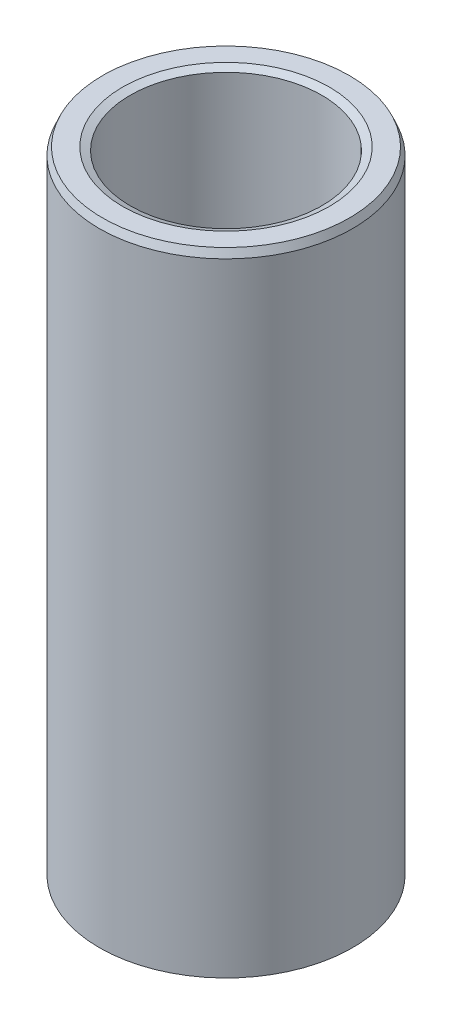
ISO-10303-21;
HEADER;
FILE_DESCRIPTION(('STEP AP214'),'2;1');
FILE_NAME('part.step','',(''),(''),'','','');
FILE_SCHEMA(('AUTOMOTIVE_DESIGN { 1 0 10303 214 1 1 1 1 }'));
ENDSEC;
DATA;
#1=APPLICATION_CONTEXT('core data for automotive mechanical design processes');
#2=APPLICATION_PROTOCOL_DEFINITION('international standard','automotive_design',2000,#1);
#3=PRODUCT_CONTEXT('',#1,'mechanical');
#4=PRODUCT('Part','Part','',(#3));
#5=PRODUCT_RELATED_PRODUCT_CATEGORY('part','',(#4));
#6=PRODUCT_DEFINITION_FORMATION('','',#4);
#7=PRODUCT_DEFINITION_CONTEXT('part definition',#1,'design');
#8=PRODUCT_DEFINITION('design','',#6,#7);
#9=PRODUCT_DEFINITION_SHAPE('','',#8);
#10=(LENGTH_UNIT() NAMED_UNIT(*) SI_UNIT(.MILLI.,.METRE.));
#11=(NAMED_UNIT(*) PLANE_ANGLE_UNIT() SI_UNIT($,.RADIAN.));
#12=(NAMED_UNIT(*) SI_UNIT($,.STERADIAN.) SOLID_ANGLE_UNIT());
#13=UNCERTAINTY_MEASURE_WITH_UNIT(LENGTH_MEASURE(1.E-05),#10,'distance_accuracy_value','');
#14=(GEOMETRIC_REPRESENTATION_CONTEXT(3) GLOBAL_UNCERTAINTY_ASSIGNED_CONTEXT((#13)) GLOBAL_UNIT_ASSIGNED_CONTEXT((#10,
#11,#12)) REPRESENTATION_CONTEXT('',''));
#15=CARTESIAN_POINT('',(0.,0.,0.));
#16=DIRECTION('',(0.,0.,1.));
#17=DIRECTION('',(1.,0.,0.));
#18=AXIS2_PLACEMENT_3D('',#15,#16,#17);
#19=CARTESIAN_POINT('',(0.,275.141454601978,0.));
#20=DIRECTION('',(0.,-1.,0.));
#21=DIRECTION('',(0.,0.,-1.));
#22=AXIS2_PLACEMENT_3D('',#19,#20,#21);
#23=CYLINDRICAL_SURFACE('',#22,55.);
#24=CARTESIAN_POINT('',(0.,1.40713131055403,0.));
#25=DIRECTION('',(0.,1.,0.));
#26=DIRECTION('',(0.,0.,1.));
#27=AXIS2_PLACEMENT_3D('',#24,#25,#26);
#28=CIRCLE('',#27,55.);
#29=CARTESIAN_POINT('',(0.,1.40713131055403,55.));
#30=VERTEX_POINT('',#29);
#31=EDGE_CURVE('E10',#30,#30,#28,.T.);
#32=ORIENTED_EDGE('',*,*,#31,.T.);
#33=EDGE_LOOP('',(#32));
#34=FACE_BOUND('',#33,.T.);
#35=CARTESIAN_POINT('',(0.,271.849503287846,0.));
#36=DIRECTION('',(0.,1.,0.));
#37=DIRECTION('',(0.,0.,1.));
#38=AXIS2_PLACEMENT_3D('',#35,#36,#37);
#39=CIRCLE('',#38,55.);
#40=CARTESIAN_POINT('',(0.,271.849503287846,-55.));
#41=VERTEX_POINT('',#40);
#42=EDGE_CURVE('E50',#41,#41,#39,.F.);
#43=ORIENTED_EDGE('',*,*,#42,.T.);
#44=EDGE_LOOP('',(#43));
#45=FACE_BOUND('',#44,.T.);
#46=ADVANCED_FACE('F39',(#34,#45),#23,.T.);
#47=CARTESIAN_POINT('',(0.,275.141454601978,0.));
#48=DIRECTION('',(0.,1.,0.));
#49=DIRECTION('',(0.,0.,1.));
#50=AXIS2_PLACEMENT_3D('',#47,#48,#49);
#51=PLANE('',#50);
#52=CARTESIAN_POINT('',(0.,275.141454601978,0.));
#53=DIRECTION('',(0.,1.,0.));
#54=DIRECTION('',(0.,0.,1.));
#55=AXIS2_PLACEMENT_3D('',#52,#53,#54);
#56=CIRCLE('',#55,44.9047040937782);
#57=CARTESIAN_POINT('',(0.,275.141454601978,44.9047040937782));
#58=VERTEX_POINT('',#57);
#59=EDGE_CURVE('E58',#58,#58,#56,.F.);
#60=ORIENTED_EDGE('',*,*,#59,.T.);
#61=EDGE_LOOP('',(#60));
#62=FACE_BOUND('',#61,.T.);
#63=CARTESIAN_POINT('',(0.,275.141454601978,0.));
#64=DIRECTION('',(0.,1.,0.));
#65=DIRECTION('',(0.,0.,1.));
#66=AXIS2_PLACEMENT_3D('',#63,#64,#65);
#67=CIRCLE('',#66,53.5928686894459);
#68=CARTESIAN_POINT('',(0.,275.141454601978,-53.5928686894459));
#69=VERTEX_POINT('',#68);
#70=EDGE_CURVE('E61',#69,#69,#67,.T.);
#71=ORIENTED_EDGE('',*,*,#70,.T.);
#72=EDGE_LOOP('',(#71));
#73=FACE_BOUND('',#72,.T.);
#74=ADVANCED_FACE('F88',(#62,#73),#51,.T.);
#75=CARTESIAN_POINT('',(0.,0.,0.));
#76=DIRECTION('',(0.,1.,0.));
#77=DIRECTION('',(0.,0.,1.));
#78=AXIS2_PLACEMENT_3D('',#75,#76,#77);
#79=PLANE('',#78);
#80=CARTESIAN_POINT('',(0.,0.,0.));
#81=DIRECTION('',(0.,1.,0.));
#82=DIRECTION('',(0.,0.,1.));
#83=AXIS2_PLACEMENT_3D('',#80,#81,#82);
#84=CIRCLE('',#83,43.0198840901999);
#85=CARTESIAN_POINT('',(0.,0.,43.0198840901999));
#86=VERTEX_POINT('',#85);
#87=EDGE_CURVE('E51',#86,#86,#84,.T.);
#88=ORIENTED_EDGE('',*,*,#87,.T.);
#89=EDGE_LOOP('',(#88));
#90=FACE_BOUND('',#89,.T.);
#91=CARTESIAN_POINT('',(0.,0.,0.));
#92=DIRECTION('',(0.,1.,0.));
#93=DIRECTION('',(0.,0.,1.));
#94=AXIS2_PLACEMENT_3D('',#91,#92,#93);
#95=CIRCLE('',#94,51.7080486858677);
#96=CARTESIAN_POINT('',(0.,0.,51.7080486858677));
#97=VERTEX_POINT('',#96);
#98=EDGE_CURVE('E54',#97,#97,#95,.F.);
#99=ORIENTED_EDGE('',*,*,#98,.T.);
#100=EDGE_LOOP('',(#99));
#101=FACE_BOUND('',#100,.T.);
#102=ADVANCED_FACE('F83',(#90,#101),#79,.F.);
#103=CARTESIAN_POINT('',(0.,275.141454601978,0.));
#104=DIRECTION('',(0.,-1.,0.));
#105=DIRECTION('',(0.,0.,-1.));
#106=AXIS2_PLACEMENT_3D('',#103,#104,#105);
#107=CYLINDRICAL_SURFACE('',#106,41.6127527796459);
#108=CARTESIAN_POINT('',(0.,273.734323291424,0.));
#109=DIRECTION('',(0.,1.,0.));
#110=DIRECTION('',(0.,0.,1.));
#111=AXIS2_PLACEMENT_3D('',#108,#109,#110);
#112=CIRCLE('',#111,41.6127527796459);
#113=CARTESIAN_POINT('',(0.,273.734323291424,41.6127527796459));
#114=VERTEX_POINT('',#113);
#115=EDGE_CURVE('E67',#114,#114,#112,.T.);
#116=ORIENTED_EDGE('',*,*,#115,.T.);
#117=EDGE_LOOP('',(#116));
#118=FACE_BOUND('',#117,.T.);
#119=CARTESIAN_POINT('',(0.,3.29195131413224,0.));
#120=DIRECTION('',(0.,1.,0.));
#121=DIRECTION('',(0.,0.,1.));
#122=AXIS2_PLACEMENT_3D('',#119,#120,#121);
#123=CIRCLE('',#122,41.6127527796459);
#124=CARTESIAN_POINT('',(0.,3.29195131413224,41.6127527796459));
#125=VERTEX_POINT('',#124);
#126=EDGE_CURVE('E69',#125,#125,#123,.F.);
#127=ORIENTED_EDGE('',*,*,#126,.T.);
#128=EDGE_LOOP('',(#127));
#129=FACE_BOUND('',#128,.T.);
#130=ADVANCED_FACE('F71',(#118,#129),#107,.F.);
#131=CARTESIAN_POINT('',(0.,273.734323291424,0.));
#132=DIRECTION('',(0.,1.,0.));
#133=DIRECTION('',(0.,0.,1.));
#134=AXIS2_PLACEMENT_3D('',#131,#132,#133);
#135=CONICAL_SURFACE('',#134,41.6127527796459,1.16685574939147);
#136=ORIENTED_EDGE('',*,*,#59,.F.);
#137=EDGE_LOOP('',(#136));
#138=FACE_BOUND('',#137,.T.);
#139=ORIENTED_EDGE('',*,*,#115,.F.);
#140=EDGE_LOOP('',(#139));
#141=FACE_BOUND('',#140,.T.);
#142=ADVANCED_FACE('F77',(#138,#141),#135,.F.);
#143=CARTESIAN_POINT('',(0.,0.,0.));
#144=DIRECTION('',(0.,-1.,0.));
#145=DIRECTION('',(0.,0.,-1.));
#146=AXIS2_PLACEMENT_3D('',#143,#144,#145);
#147=CONICAL_SURFACE('',#146,43.0198840901999,0.403940577403425);
#148=ORIENTED_EDGE('',*,*,#126,.F.);
#149=EDGE_LOOP('',(#148));
#150=FACE_BOUND('',#149,.T.);
#151=ORIENTED_EDGE('',*,*,#87,.F.);
#152=EDGE_LOOP('',(#151));
#153=FACE_BOUND('',#152,.T.);
#154=ADVANCED_FACE('F73',(#150,#153),#147,.F.);
#155=CARTESIAN_POINT('',(0.,1.40713131055403,0.));
#156=DIRECTION('',(0.,1.,0.));
#157=DIRECTION('',(0.,0.,1.));
#158=AXIS2_PLACEMENT_3D('',#155,#156,#157);
#159=CONICAL_SURFACE('',#158,55.,1.16685574939148);
#160=ORIENTED_EDGE('',*,*,#98,.F.);
#161=EDGE_LOOP('',(#160));
#162=FACE_BOUND('',#161,.T.);
#163=ORIENTED_EDGE('',*,*,#31,.F.);
#164=EDGE_LOOP('',(#163));
#165=FACE_BOUND('',#164,.T.);
#166=ADVANCED_FACE('F76',(#162,#165),#159,.T.);
#167=CARTESIAN_POINT('',(0.,275.141454601978,0.));
#168=DIRECTION('',(0.,-1.,0.));
#169=DIRECTION('',(0.,0.,-1.));
#170=AXIS2_PLACEMENT_3D('',#167,#168,#169);
#171=CONICAL_SURFACE('',#170,53.5928686894459,0.403940577403421);
#172=CARTESIAN_POINT('',(0.,271.849503287846,-55.));
#173=CARTESIAN_POINT('',(0.,271.883794447368,-54.9853423821817));
#174=CARTESIAN_POINT('',(0.,271.91808560689,-54.9706847643635));
#175=CARTESIAN_POINT('',(0.,271.986667925935,-54.9413695287269));
#176=CARTESIAN_POINT('',(0.,272.020959085457,-54.9267119109087));
#177=CARTESIAN_POINT('',(0.,272.089541404502,-54.8973966752721));
#178=CARTESIAN_POINT('',(0.,272.123832564024,-54.8827390574538));
#179=CARTESIAN_POINT('',(0.,272.192414883068,-54.8534238218173));
#180=CARTESIAN_POINT('',(0.,272.22670604259,-54.838766203999));
#181=CARTESIAN_POINT('',(0.,272.295288361635,-54.8094509683625));
#182=CARTESIAN_POINT('',(0.,272.329579521157,-54.7947933505442));
#183=CARTESIAN_POINT('',(0.,272.398161840201,-54.7654781149077));
#184=CARTESIAN_POINT('',(0.,272.432452999724,-54.7508204970894));
#185=CARTESIAN_POINT('',(0.,272.501035318768,-54.7215052614529));
#186=CARTESIAN_POINT('',(0.,272.53532647829,-54.7068476436346));
#187=CARTESIAN_POINT('',(0.,272.603908797335,-54.677532407998));
#188=CARTESIAN_POINT('',(0.,272.638199956857,-54.6628747901798));
#189=CARTESIAN_POINT('',(0.,272.706782275901,-54.6335595545432));
#190=CARTESIAN_POINT('',(0.,272.741073435424,-54.618901936725));
#191=CARTESIAN_POINT('',(0.,272.809655754468,-54.5895867010884));
#192=CARTESIAN_POINT('',(0.,272.84394691399,-54.5749290832701));
#193=CARTESIAN_POINT('',(0.,272.912529233035,-54.5456138476336));
#194=CARTESIAN_POINT('',(0.,272.946820392557,-54.5309562298153));
#195=CARTESIAN_POINT('',(0.,273.015402711601,-54.5016409941788));
#196=CARTESIAN_POINT('',(0.,273.049693871124,-54.4869833763605));
#197=CARTESIAN_POINT('',(0.,273.118276190168,-54.457668140724));
#198=CARTESIAN_POINT('',(0.,273.15256734969,-54.4430105229057));
#199=CARTESIAN_POINT('',(0.,273.221149668734,-54.4136952872691));
#200=CARTESIAN_POINT('',(0.,273.255440828257,-54.3990376694509));
#201=CARTESIAN_POINT('',(0.,273.324023147301,-54.3697224338143));
#202=CARTESIAN_POINT('',(0.,273.358314306823,-54.3550648159961));
#203=CARTESIAN_POINT('',(0.,273.426896625868,-54.3257495803595));
#204=CARTESIAN_POINT('',(0.,273.46118778539,-54.3110919625412));
#205=CARTESIAN_POINT('',(0.,273.529770104434,-54.2817767269047));
#206=CARTESIAN_POINT('',(0.,273.564061263957,-54.2671191090864));
#207=CARTESIAN_POINT('',(0.,273.632643583001,-54.2378038734499));
#208=CARTESIAN_POINT('',(0.,273.666934742523,-54.2231462556316));
#209=CARTESIAN_POINT('',(0.,273.735517061568,-54.1938310199951));
#210=CARTESIAN_POINT('',(0.,273.76980822109,-54.1791734021768));
#211=CARTESIAN_POINT('',(0.,273.838390540134,-54.1498581665403));
#212=CARTESIAN_POINT('',(0.,273.872681699657,-54.135200548722));
#213=CARTESIAN_POINT('',(0.,273.941264018701,-54.1058853130855));
#214=CARTESIAN_POINT('',(0.,273.975555178223,-54.0912276952672));
#215=CARTESIAN_POINT('',(0.,274.044137497268,-54.0619124596306));
#216=CARTESIAN_POINT('',(0.,274.07842865679,-54.0472548418124));
#217=CARTESIAN_POINT('',(0.,274.147010975834,-54.0179396061758));
#218=CARTESIAN_POINT('',(0.,274.181302135357,-54.0032819883575));
#219=CARTESIAN_POINT('',(0.,274.249884454401,-53.973966752721));
#220=CARTESIAN_POINT('',(0.,274.284175613923,-53.9593091349027));
#221=CARTESIAN_POINT('',(0.,274.352757932968,-53.9299938992662));
#222=CARTESIAN_POINT('',(0.,274.38704909249,-53.9153362814479));
#223=CARTESIAN_POINT('',(0.,274.455631411534,-53.8860210458114));
#224=CARTESIAN_POINT('',(0.,274.489922571056,-53.8713634279931));
#225=CARTESIAN_POINT('',(0.,274.558504890101,-53.8420481923566));
#226=CARTESIAN_POINT('',(0.,274.592796049623,-53.8273905745383));
#227=CARTESIAN_POINT('',(0.,274.661378368667,-53.7980753389017));
#228=CARTESIAN_POINT('',(0.,274.69566952819,-53.7834177210835));
#229=CARTESIAN_POINT('',(0.,274.764251847234,-53.7541024854469));
#230=CARTESIAN_POINT('',(0.,274.798543006756,-53.7394448676287));
#231=CARTESIAN_POINT('',(0.,274.867125325801,-53.7101296319921));
#232=CARTESIAN_POINT('',(0.,274.901416485323,-53.6954720141738));
#233=CARTESIAN_POINT('',(0.,274.969998804367,-53.6661567785373));
#234=CARTESIAN_POINT('',(0.,275.00428996389,-53.651499160719));
#235=CARTESIAN_POINT('',(0.,275.072872282934,-53.6221839250825));
#236=CARTESIAN_POINT('',(0.,275.107163442456,-53.6075263072642));
#237=CARTESIAN_POINT('',(0.,275.141454601978,-53.5928686894459));
#238=B_SPLINE_CURVE_WITH_KNOTS('',3,(#172,#173,#174,#175,#176,#177,#178,#179,#180,#181,#182,
#183,#184,#185,#186,#187,#188,#189,#190,#191,#192,#193,#194,#195,#196,#197,#198,#199,#200,#201,
#202,#203,#204,#205,#206,#207,#208,#209,#210,#211,#212,#213,#214,#215,#216,#217,#218,#219,#220,
#221,#222,#223,#224,#225,#226,#227,#228,#229,#230,#231,#232,#233,#234,#235,#236,#237),
.UNSPECIFIED.,.F.,.F.,(4,2,2,2,2,2,2,2,2,2,2,2,2,2,2,2,2,2,2,2,2,2,2,2,2,2,2,2,2,2,2,2,4),(0.,
0.111877452747951,0.22375490549585,0.335632358243747,0.447509810991647,0.559387263739547,
0.671264716487444,0.783142169235344,0.895019621983241,1.00689707473114,1.11877452747904,
1.23065198022694,1.34252943297484,1.45440688572274,1.56628433847063,1.67816179121853,
1.79003924396643,1.90191669671438,2.01379414946228,2.12567160221018,2.23754905495808,
2.34942650770598,2.46130396045388,2.57318141320177,2.68505886594967,2.79693631869757,
2.90881377144547,3.02069122419337,3.13256867694127,3.24444612968917,3.35632358243707,
3.46820103518497,3.58007848793291),.UNSPECIFIED.);
#239=EDGE_CURVE('BSEAM45',#41,#69,#238,.T.);
#240=ORIENTED_EDGE('',*,*,#42,.F.);
#241=ORIENTED_EDGE('',*,*,#70,.F.);
#242=ORIENTED_EDGE('',*,*,#239,.T.);
#243=ORIENTED_EDGE('',*,*,#239,.F.);
#244=EDGE_LOOP('',(#240,#242,#241,#243));
#245=FACE_BOUND('',#244,.T.);
#246=ADVANCED_FACE('F45',(#245),#171,.T.);
#247=CLOSED_SHELL('',(#46,#74,#102,#130,#142,#154,#166,#246));
#248=MANIFOLD_SOLID_BREP('B2',#247);
#249=ADVANCED_BREP_SHAPE_REPRESENTATION('',(#18,#248),#14);
#250=SHAPE_DEFINITION_REPRESENTATION(#9,#249);
ENDSEC;
END-ISO-10303-21;
